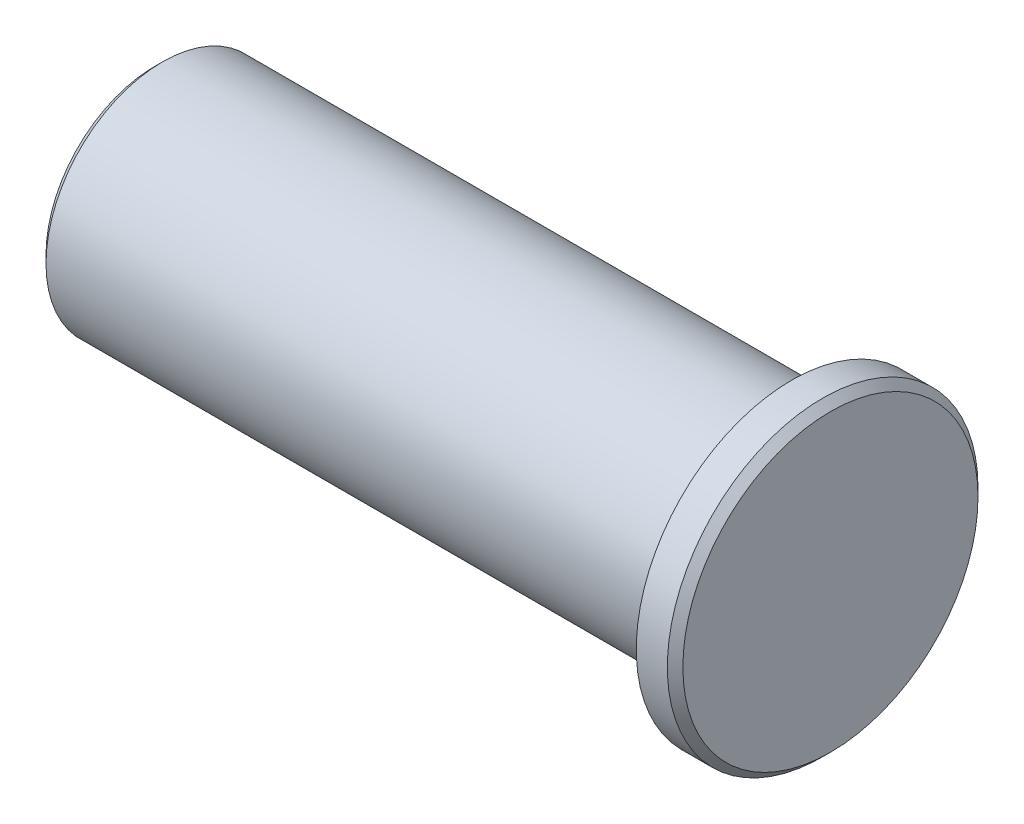
ISO-10303-21;
HEADER;
FILE_DESCRIPTION(('STEP AP214'),'2;1');
FILE_NAME('part.step','',(''),(''),'','','');
FILE_SCHEMA(('AUTOMOTIVE_DESIGN { 1 0 10303 214 1 1 1 1 }'));
ENDSEC;
DATA;
#1=APPLICATION_CONTEXT('core data for automotive mechanical design processes');
#2=APPLICATION_PROTOCOL_DEFINITION('international standard','automotive_design',2000,#1);
#3=PRODUCT_CONTEXT('',#1,'mechanical');
#4=PRODUCT('Part','Part','',(#3));
#5=PRODUCT_RELATED_PRODUCT_CATEGORY('part','',(#4));
#6=PRODUCT_DEFINITION_FORMATION('','',#4);
#7=PRODUCT_DEFINITION_CONTEXT('part definition',#1,'design');
#8=PRODUCT_DEFINITION('design','',#6,#7);
#9=PRODUCT_DEFINITION_SHAPE('','',#8);
#10=(LENGTH_UNIT() NAMED_UNIT(*) SI_UNIT(.MILLI.,.METRE.));
#11=(NAMED_UNIT(*) PLANE_ANGLE_UNIT() SI_UNIT($,.RADIAN.));
#12=(NAMED_UNIT(*) SI_UNIT($,.STERADIAN.) SOLID_ANGLE_UNIT());
#13=UNCERTAINTY_MEASURE_WITH_UNIT(LENGTH_MEASURE(1.E-05),#10,'distance_accuracy_value','');
#14=(GEOMETRIC_REPRESENTATION_CONTEXT(3) GLOBAL_UNCERTAINTY_ASSIGNED_CONTEXT((#13)) GLOBAL_UNIT_ASSIGNED_CONTEXT((#10,
#11,#12)) REPRESENTATION_CONTEXT('',''));
#15=CARTESIAN_POINT('',(0.,0.,0.));
#16=DIRECTION('',(0.,0.,1.));
#17=DIRECTION('',(1.,0.,0.));
#18=AXIS2_PLACEMENT_3D('',#15,#16,#17);
#19=CARTESIAN_POINT('',(82.,0.,0.));
#20=DIRECTION('',(-1.,0.,0.));
#21=DIRECTION('',(0.,0.,1.));
#22=AXIS2_PLACEMENT_3D('',#19,#20,#21);
#23=CYLINDRICAL_SURFACE('',#22,15.);
#24=CARTESIAN_POINT('',(1.,0.,0.));
#25=DIRECTION('',(1.,0.,0.));
#26=DIRECTION('',(0.,0.,-1.));
#27=AXIS2_PLACEMENT_3D('',#24,#25,#26);
#28=CIRCLE('',#27,15.);
#29=CARTESIAN_POINT('',(1.,0.,-15.));
#30=VERTEX_POINT('',#29);
#31=EDGE_CURVE('E64',#30,#30,#28,.T.);
#32=ORIENTED_EDGE('',*,*,#31,.T.);
#33=EDGE_LOOP('',(#32));
#34=FACE_BOUND('',#33,.T.);
#35=CARTESIAN_POINT('',(82.,0.,0.));
#36=DIRECTION('',(1.,0.,0.));
#37=DIRECTION('',(0.,0.,-1.));
#38=AXIS2_PLACEMENT_3D('',#35,#36,#37);
#39=CIRCLE('',#38,15.);
#40=CARTESIAN_POINT('',(82.,0.,-15.));
#41=VERTEX_POINT('',#40);
#42=EDGE_CURVE('E57',#41,#41,#39,.T.);
#43=ORIENTED_EDGE('',*,*,#42,.F.);
#44=EDGE_LOOP('',(#43));
#45=FACE_BOUND('',#44,.T.);
#46=ADVANCED_FACE('F34',(#34,#45),#23,.T.);
#47=CARTESIAN_POINT('',(0.,0.,0.));
#48=DIRECTION('',(1.,0.,0.));
#49=DIRECTION('',(0.,0.,-1.));
#50=AXIS2_PLACEMENT_3D('',#47,#48,#49);
#51=PLANE('',#50);
#52=CARTESIAN_POINT('',(0.,0.,0.));
#53=DIRECTION('',(-1.,0.,0.));
#54=DIRECTION('',(0.,0.,1.));
#55=AXIS2_PLACEMENT_3D('',#52,#53,#54);
#56=CIRCLE('',#55,3.39999999999999);
#57=CARTESIAN_POINT('',(0.,0.,3.39999999999999));
#58=VERTEX_POINT('',#57);
#59=EDGE_CURVE('E54',#58,#58,#56,.T.);
#60=ORIENTED_EDGE('',*,*,#59,.F.);
#61=EDGE_LOOP('',(#60));
#62=FACE_BOUND('',#61,.T.);
#63=CARTESIAN_POINT('',(0.,0.,0.));
#64=DIRECTION('',(1.,0.,0.));
#65=DIRECTION('',(0.,0.,-1.));
#66=AXIS2_PLACEMENT_3D('',#63,#64,#65);
#67=CIRCLE('',#66,14.);
#68=CARTESIAN_POINT('',(0.,0.,-14.));
#69=VERTEX_POINT('',#68);
#70=EDGE_CURVE('E67',#69,#69,#67,.F.);
#71=ORIENTED_EDGE('',*,*,#70,.T.);
#72=EDGE_LOOP('',(#71));
#73=FACE_BOUND('',#72,.T.);
#74=ADVANCED_FACE('F84',(#62,#73),#51,.F.);
#75=CARTESIAN_POINT('',(87.,0.,0.));
#76=DIRECTION('',(-1.,0.,0.));
#77=DIRECTION('',(0.,0.,1.));
#78=AXIS2_PLACEMENT_3D('',#75,#76,#77);
#79=CYLINDRICAL_SURFACE('',#78,20.);
#80=CARTESIAN_POINT('',(86.,0.,0.));
#81=DIRECTION('',(1.,0.,0.));
#82=DIRECTION('',(0.,0.,-1.));
#83=AXIS2_PLACEMENT_3D('',#80,#81,#82);
#84=CIRCLE('',#83,20.);
#85=CARTESIAN_POINT('',(86.,0.,-20.));
#86=VERTEX_POINT('',#85);
#87=EDGE_CURVE('E11',#86,#86,#84,.F.);
#88=ORIENTED_EDGE('',*,*,#87,.T.);
#89=EDGE_LOOP('',(#88));
#90=FACE_BOUND('',#89,.T.);
#91=CARTESIAN_POINT('',(82.,0.,0.));
#92=DIRECTION('',(1.,0.,0.));
#93=DIRECTION('',(0.,0.,-1.));
#94=AXIS2_PLACEMENT_3D('',#91,#92,#93);
#95=CIRCLE('',#94,20.);
#96=CARTESIAN_POINT('',(82.,0.,-20.));
#97=VERTEX_POINT('',#96);
#98=EDGE_CURVE('E53',#97,#97,#95,.T.);
#99=ORIENTED_EDGE('',*,*,#98,.T.);
#100=EDGE_LOOP('',(#99));
#101=FACE_BOUND('',#100,.T.);
#102=ADVANCED_FACE('F90',(#90,#101),#79,.T.);
#103=CARTESIAN_POINT('',(87.,0.,0.));
#104=DIRECTION('',(1.,0.,0.));
#105=DIRECTION('',(0.,0.,-1.));
#106=AXIS2_PLACEMENT_3D('',#103,#104,#105);
#107=PLANE('',#106);
#108=CARTESIAN_POINT('',(87.,0.,0.));
#109=DIRECTION('',(1.,0.,0.));
#110=DIRECTION('',(0.,0.,-1.));
#111=AXIS2_PLACEMENT_3D('',#108,#109,#110);
#112=CIRCLE('',#111,19.);
#113=CARTESIAN_POINT('',(87.,0.,-19.));
#114=VERTEX_POINT('',#113);
#115=EDGE_CURVE('E41',#114,#114,#112,.T.);
#116=ORIENTED_EDGE('',*,*,#115,.T.);
#117=EDGE_LOOP('',(#116));
#118=FACE_BOUND('',#117,.T.);
#119=ADVANCED_FACE('F72',(#118),#107,.T.);
#120=CARTESIAN_POINT('',(82.,0.,0.));
#121=DIRECTION('',(1.,0.,0.));
#122=DIRECTION('',(0.,0.,-1.));
#123=AXIS2_PLACEMENT_3D('',#120,#121,#122);
#124=PLANE('',#123);
#125=ORIENTED_EDGE('',*,*,#42,.T.);
#126=EDGE_LOOP('',(#125));
#127=FACE_BOUND('',#126,.T.);
#128=ORIENTED_EDGE('',*,*,#98,.F.);
#129=EDGE_LOOP('',(#128));
#130=FACE_BOUND('',#129,.T.);
#131=ADVANCED_FACE('F80',(#127,#130),#124,.F.);
#132=CARTESIAN_POINT('',(1.,0.,0.));
#133=DIRECTION('',(1.,0.,0.));
#134=DIRECTION('',(0.,0.,-1.));
#135=AXIS2_PLACEMENT_3D('',#132,#133,#134);
#136=CONICAL_SURFACE('',#135,15.,0.785398163397451);
#137=ORIENTED_EDGE('',*,*,#70,.F.);
#138=EDGE_LOOP('',(#137));
#139=FACE_BOUND('',#138,.T.);
#140=ORIENTED_EDGE('',*,*,#31,.F.);
#141=EDGE_LOOP('',(#140));
#142=FACE_BOUND('',#141,.T.);
#143=ADVANCED_FACE('F75',(#139,#142),#136,.T.);
#144=CARTESIAN_POINT('',(87.,0.,0.));
#145=DIRECTION('',(-1.,0.,0.));
#146=DIRECTION('',(0.,0.,1.));
#147=AXIS2_PLACEMENT_3D('',#144,#145,#146);
#148=CONICAL_SURFACE('',#147,19.,0.78539816339744);
#149=ORIENTED_EDGE('',*,*,#87,.F.);
#150=EDGE_LOOP('',(#149));
#151=FACE_BOUND('',#150,.T.);
#152=ORIENTED_EDGE('',*,*,#115,.F.);
#153=EDGE_LOOP('',(#152));
#154=FACE_BOUND('',#153,.T.);
#155=ADVANCED_FACE('F36',(#151,#154),#148,.T.);
#156=CARTESIAN_POINT('',(15.,0.,0.));
#157=DIRECTION('',(-1.,0.,0.));
#158=DIRECTION('',(0.,0.,1.));
#159=AXIS2_PLACEMENT_3D('',#156,#157,#158);
#160=CONICAL_SURFACE('',#159,3.39999999999999,1.02974425867665);
#161=CARTESIAN_POINT('',(17.0429261046937,0.,0.));
#162=VERTEX_POINT('',#161);
#163=VERTEX_LOOP('',#162);
#164=FACE_BOUND('',#163,.T.);
#165=CARTESIAN_POINT('',(15.,0.,0.));
#166=DIRECTION('',(-1.,0.,0.));
#167=DIRECTION('',(0.,0.,1.));
#168=AXIS2_PLACEMENT_3D('',#165,#166,#167);
#169=CIRCLE('',#168,3.39999999999999);
#170=CARTESIAN_POINT('',(15.,0.,3.39999999999999));
#171=VERTEX_POINT('',#170);
#172=EDGE_CURVE('E51',#171,#171,#169,.T.);
#173=ORIENTED_EDGE('',*,*,#172,.T.);
#174=EDGE_LOOP('',(#173));
#175=FACE_BOUND('',#174,.T.);
#176=ADVANCED_FACE('F44',(#164,#175),#160,.F.);
#177=CARTESIAN_POINT('',(0.,0.,0.));
#178=DIRECTION('',(-1.,0.,0.));
#179=DIRECTION('',(0.,0.,1.));
#180=AXIS2_PLACEMENT_3D('',#177,#178,#179);
#181=CYLINDRICAL_SURFACE('',#180,3.39999999999999);
#182=ORIENTED_EDGE('',*,*,#172,.F.);
#183=EDGE_LOOP('',(#182));
#184=FACE_BOUND('',#183,.T.);
#185=ORIENTED_EDGE('',*,*,#59,.T.);
#186=EDGE_LOOP('',(#185));
#187=FACE_BOUND('',#186,.T.);
#188=ADVANCED_FACE('F47',(#184,#187),#181,.F.);
#189=CLOSED_SHELL('',(#46,#74,#102,#119,#131,#143,#155,#176,#188));
#190=MANIFOLD_SOLID_BREP('B2',#189);
#191=ADVANCED_BREP_SHAPE_REPRESENTATION('',(#18,#190),#14);
#192=SHAPE_DEFINITION_REPRESENTATION(#9,#191);
ENDSEC;
END-ISO-10303-21;
